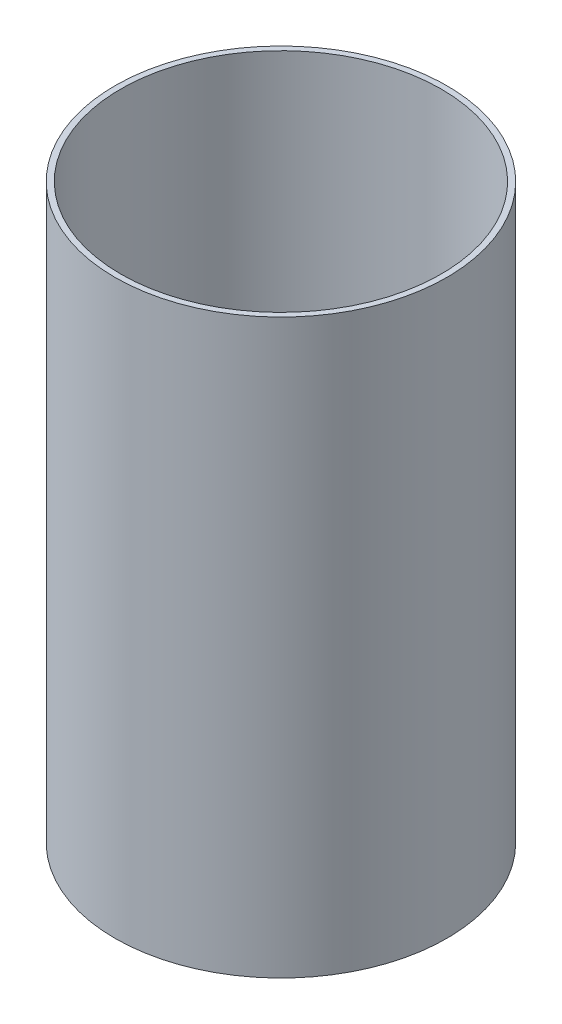
ISO-10303-21;
HEADER;
FILE_DESCRIPTION(('STEP AP214'),'2;1');
FILE_NAME('part.step','',(''),(''),'','','');
FILE_SCHEMA(('AUTOMOTIVE_DESIGN { 1 0 10303 214 1 1 1 1 }'));
ENDSEC;
DATA;
#1=APPLICATION_CONTEXT('core data for automotive mechanical design processes');
#2=APPLICATION_PROTOCOL_DEFINITION('international standard','automotive_design',2000,#1);
#3=PRODUCT_CONTEXT('',#1,'mechanical');
#4=PRODUCT('Part','Part','',(#3));
#5=PRODUCT_RELATED_PRODUCT_CATEGORY('part','',(#4));
#6=PRODUCT_DEFINITION_FORMATION('','',#4);
#7=PRODUCT_DEFINITION_CONTEXT('part definition',#1,'design');
#8=PRODUCT_DEFINITION('design','',#6,#7);
#9=PRODUCT_DEFINITION_SHAPE('','',#8);
#10=(LENGTH_UNIT() NAMED_UNIT(*) SI_UNIT(.MILLI.,.METRE.));
#11=(NAMED_UNIT(*) PLANE_ANGLE_UNIT() SI_UNIT($,.RADIAN.));
#12=(NAMED_UNIT(*) SI_UNIT($,.STERADIAN.) SOLID_ANGLE_UNIT());
#13=UNCERTAINTY_MEASURE_WITH_UNIT(LENGTH_MEASURE(1.E-05),#10,'distance_accuracy_value','');
#14=(GEOMETRIC_REPRESENTATION_CONTEXT(3) GLOBAL_UNCERTAINTY_ASSIGNED_CONTEXT((#13)) GLOBAL_UNIT_ASSIGNED_CONTEXT((#10,
#11,#12)) REPRESENTATION_CONTEXT('',''));
#15=CARTESIAN_POINT('',(0.,0.,0.));
#16=DIRECTION('',(0.,0.,1.));
#17=DIRECTION('',(1.,0.,0.));
#18=AXIS2_PLACEMENT_3D('',#15,#16,#17);
#19=CARTESIAN_POINT('',(0.,50.,0.));
#20=DIRECTION('',(0.,-1.,0.));
#21=DIRECTION('',(0.,0.,-1.));
#22=AXIS2_PLACEMENT_3D('',#19,#20,#21);
#23=CYLINDRICAL_SURFACE('',#22,14.5);
#24=CARTESIAN_POINT('',(0.,50.,0.));
#25=DIRECTION('',(0.,1.,0.));
#26=DIRECTION('',(0.,0.,1.));
#27=AXIS2_PLACEMENT_3D('',#24,#25,#26);
#28=CIRCLE('',#27,14.5);
#29=CARTESIAN_POINT('',(0.,50.,14.5));
#30=VERTEX_POINT('',#29);
#31=EDGE_CURVE('E10',#30,#30,#28,.T.);
#32=ORIENTED_EDGE('',*,*,#31,.F.);
#33=EDGE_LOOP('',(#32));
#34=FACE_BOUND('',#33,.T.);
#35=CARTESIAN_POINT('',(0.,0.,0.));
#36=DIRECTION('',(0.,1.,0.));
#37=DIRECTION('',(0.,0.,1.));
#38=AXIS2_PLACEMENT_3D('',#35,#36,#37);
#39=CIRCLE('',#38,14.5);
#40=CARTESIAN_POINT('',(0.,0.,14.5));
#41=VERTEX_POINT('',#40);
#42=EDGE_CURVE('E39',#41,#41,#39,.T.);
#43=ORIENTED_EDGE('',*,*,#42,.T.);
#44=EDGE_LOOP('',(#43));
#45=FACE_BOUND('',#44,.T.);
#46=ADVANCED_FACE('F36',(#34,#45),#23,.T.);
#47=CARTESIAN_POINT('',(0.,50.,0.));
#48=DIRECTION('',(0.,1.,0.));
#49=DIRECTION('',(0.,0.,1.));
#50=AXIS2_PLACEMENT_3D('',#47,#48,#49);
#51=PLANE('',#50);
#52=CARTESIAN_POINT('',(0.,50.,0.));
#53=DIRECTION('',(0.,1.,0.));
#54=DIRECTION('',(0.,0.,1.));
#55=AXIS2_PLACEMENT_3D('',#52,#53,#54);
#56=CIRCLE('',#55,14.);
#57=CARTESIAN_POINT('',(0.,50.,14.));
#58=VERTEX_POINT('',#57);
#59=EDGE_CURVE('E48',#58,#58,#56,.T.);
#60=ORIENTED_EDGE('',*,*,#59,.F.);
#61=EDGE_LOOP('',(#60));
#62=FACE_BOUND('',#61,.T.);
#63=ORIENTED_EDGE('',*,*,#31,.T.);
#64=EDGE_LOOP('',(#63));
#65=FACE_BOUND('',#64,.T.);
#66=ADVANCED_FACE('F63',(#62,#65),#51,.T.);
#67=CARTESIAN_POINT('',(0.,0.,0.));
#68=DIRECTION('',(0.,1.,0.));
#69=DIRECTION('',(0.,0.,1.));
#70=AXIS2_PLACEMENT_3D('',#67,#68,#69);
#71=PLANE('',#70);
#72=ORIENTED_EDGE('',*,*,#42,.F.);
#73=EDGE_LOOP('',(#72));
#74=FACE_BOUND('',#73,.T.);
#75=ADVANCED_FACE('F59',(#74),#71,.F.);
#76=CARTESIAN_POINT('',(0.,0.999999999999994,0.));
#77=DIRECTION('',(0.,1.,0.));
#78=DIRECTION('',(0.,0.,1.));
#79=AXIS2_PLACEMENT_3D('',#76,#77,#78);
#80=CYLINDRICAL_SURFACE('',#79,14.);
#81=CARTESIAN_POINT('',(0.,0.999999999999994,0.));
#82=DIRECTION('',(0.,1.,0.));
#83=DIRECTION('',(0.,0.,1.));
#84=AXIS2_PLACEMENT_3D('',#81,#82,#83);
#85=CIRCLE('',#84,14.);
#86=CARTESIAN_POINT('',(0.,0.999999999999994,14.));
#87=VERTEX_POINT('',#86);
#88=EDGE_CURVE('E46',#87,#87,#85,.T.);
#89=ORIENTED_EDGE('',*,*,#88,.F.);
#90=EDGE_LOOP('',(#89));
#91=FACE_BOUND('',#90,.T.);
#92=ORIENTED_EDGE('',*,*,#59,.T.);
#93=EDGE_LOOP('',(#92));
#94=FACE_BOUND('',#93,.T.);
#95=ADVANCED_FACE('F56',(#91,#94),#80,.F.);
#96=CARTESIAN_POINT('',(0.,0.999999999999994,0.));
#97=DIRECTION('',(0.,1.,0.));
#98=DIRECTION('',(0.,0.,1.));
#99=AXIS2_PLACEMENT_3D('',#96,#97,#98);
#100=PLANE('',#99);
#101=ORIENTED_EDGE('',*,*,#88,.T.);
#102=EDGE_LOOP('',(#101));
#103=FACE_BOUND('',#102,.T.);
#104=ADVANCED_FACE('F54',(#103),#100,.T.);
#105=CLOSED_SHELL('',(#46,#66,#75,#95,#104));
#106=MANIFOLD_SOLID_BREP('B2',#105);
#107=ADVANCED_BREP_SHAPE_REPRESENTATION('',(#18,#106),#14);
#108=SHAPE_DEFINITION_REPRESENTATION(#9,#107);
ENDSEC;
END-ISO-10303-21;
